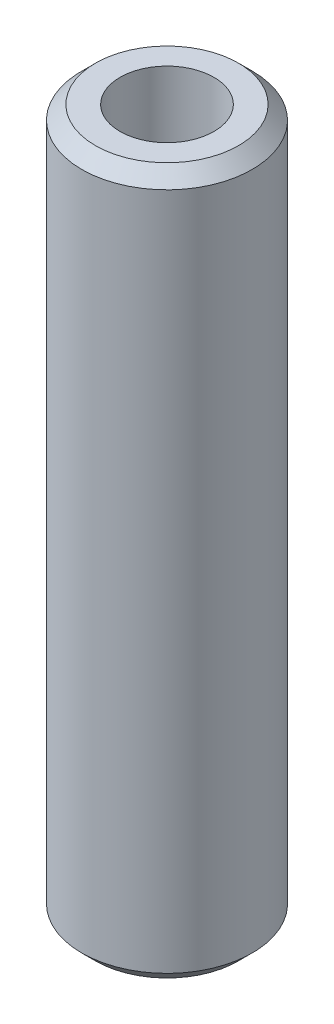
ISO-10303-21;
HEADER;
FILE_DESCRIPTION(('STEP AP214'),'2;1');
FILE_NAME('part.step','',(''),(''),'','','');
FILE_SCHEMA(('AUTOMOTIVE_DESIGN { 1 0 10303 214 1 1 1 1 }'));
ENDSEC;
DATA;
#1=APPLICATION_CONTEXT('core data for automotive mechanical design processes');
#2=APPLICATION_PROTOCOL_DEFINITION('international standard','automotive_design',2000,#1);
#3=PRODUCT_CONTEXT('',#1,'mechanical');
#4=PRODUCT('Part','Part','',(#3));
#5=PRODUCT_RELATED_PRODUCT_CATEGORY('part','',(#4));
#6=PRODUCT_DEFINITION_FORMATION('','',#4);
#7=PRODUCT_DEFINITION_CONTEXT('part definition',#1,'design');
#8=PRODUCT_DEFINITION('design','',#6,#7);
#9=PRODUCT_DEFINITION_SHAPE('','',#8);
#10=(LENGTH_UNIT() NAMED_UNIT(*) SI_UNIT(.MILLI.,.METRE.));
#11=(NAMED_UNIT(*) PLANE_ANGLE_UNIT() SI_UNIT($,.RADIAN.));
#12=(NAMED_UNIT(*) SI_UNIT($,.STERADIAN.) SOLID_ANGLE_UNIT());
#13=UNCERTAINTY_MEASURE_WITH_UNIT(LENGTH_MEASURE(1.E-05),#10,'distance_accuracy_value','');
#14=(GEOMETRIC_REPRESENTATION_CONTEXT(3) GLOBAL_UNCERTAINTY_ASSIGNED_CONTEXT((#13)) GLOBAL_UNIT_ASSIGNED_CONTEXT((#10,
#11,#12)) REPRESENTATION_CONTEXT('',''));
#15=CARTESIAN_POINT('',(0.,0.,0.));
#16=DIRECTION('',(0.,0.,1.));
#17=DIRECTION('',(1.,0.,0.));
#18=AXIS2_PLACEMENT_3D('',#15,#16,#17);
#19=CARTESIAN_POINT('',(0.,186.33929071321,0.));
#20=DIRECTION('',(0.,-1.,0.));
#21=DIRECTION('',(0.,0.,-1.));
#22=AXIS2_PLACEMENT_3D('',#19,#20,#21);
#23=CYLINDRICAL_SURFACE('',#22,22.5);
#24=CARTESIAN_POINT('',(0.,182.714145136499,0.));
#25=DIRECTION('',(0.,1.,0.));
#26=DIRECTION('',(0.,0.,1.));
#27=AXIS2_PLACEMENT_3D('',#24,#25,#26);
#28=CIRCLE('',#27,22.5);
#29=CARTESIAN_POINT('',(0.,182.714145136499,22.5));
#30=VERTEX_POINT('',#29);
#31=EDGE_CURVE('E50',#30,#30,#28,.F.);
#32=ORIENTED_EDGE('',*,*,#31,.T.);
#33=EDGE_LOOP('',(#32));
#34=FACE_BOUND('',#33,.T.);
#35=CARTESIAN_POINT('',(0.,3.62514557671095,0.));
#36=DIRECTION('',(0.,1.,0.));
#37=DIRECTION('',(0.,0.,1.));
#38=AXIS2_PLACEMENT_3D('',#35,#36,#37);
#39=CIRCLE('',#38,22.5);
#40=CARTESIAN_POINT('',(0.,3.62514557671095,22.5));
#41=VERTEX_POINT('',#40);
#42=EDGE_CURVE('E51',#41,#41,#39,.T.);
#43=ORIENTED_EDGE('',*,*,#42,.T.);
#44=EDGE_LOOP('',(#43));
#45=FACE_BOUND('',#44,.T.);
#46=ADVANCED_FACE('F39',(#34,#45),#23,.T.);
#47=CARTESIAN_POINT('',(0.,186.33929071321,0.));
#48=DIRECTION('',(0.,1.,0.));
#49=DIRECTION('',(0.,0.,1.));
#50=AXIS2_PLACEMENT_3D('',#47,#48,#49);
#51=PLANE('',#50);
#52=CARTESIAN_POINT('',(0.,186.33929071321,0.));
#53=DIRECTION('',(0.,1.,0.));
#54=DIRECTION('',(0.,0.,1.));
#55=AXIS2_PLACEMENT_3D('',#52,#53,#54);
#56=CIRCLE('',#55,18.8748544232891);
#57=CARTESIAN_POINT('',(0.,186.33929071321,18.8748544232891));
#58=VERTEX_POINT('',#57);
#59=EDGE_CURVE('E54',#58,#58,#56,.T.);
#60=ORIENTED_EDGE('',*,*,#59,.T.);
#61=EDGE_LOOP('',(#60));
#62=FACE_BOUND('',#61,.T.);
#63=CARTESIAN_POINT('',(0.,186.33929071321,0.));
#64=DIRECTION('',(0.,1.,0.));
#65=DIRECTION('',(0.,0.,1.));
#66=AXIS2_PLACEMENT_3D('',#63,#64,#65);
#67=CIRCLE('',#66,12.3929980128134);
#68=CARTESIAN_POINT('',(0.,186.33929071321,12.3929980128134));
#69=VERTEX_POINT('',#68);
#70=EDGE_CURVE('E58',#69,#69,#67,.T.);
#71=ORIENTED_EDGE('',*,*,#70,.F.);
#72=EDGE_LOOP('',(#71));
#73=FACE_BOUND('',#72,.T.);
#74=ADVANCED_FACE('F69',(#62,#73),#51,.T.);
#75=CARTESIAN_POINT('',(0.,0.,0.));
#76=DIRECTION('',(0.,1.,0.));
#77=DIRECTION('',(0.,0.,1.));
#78=AXIS2_PLACEMENT_3D('',#75,#76,#77);
#79=PLANE('',#78);
#80=CARTESIAN_POINT('',(0.,0.,0.));
#81=DIRECTION('',(0.,1.,0.));
#82=DIRECTION('',(0.,0.,1.));
#83=AXIS2_PLACEMENT_3D('',#80,#81,#82);
#84=CIRCLE('',#83,18.8748544232891);
#85=CARTESIAN_POINT('',(0.,0.,18.8748544232891));
#86=VERTEX_POINT('',#85);
#87=EDGE_CURVE('E10',#86,#86,#84,.F.);
#88=ORIENTED_EDGE('',*,*,#87,.T.);
#89=EDGE_LOOP('',(#88));
#90=FACE_BOUND('',#89,.T.);
#91=CARTESIAN_POINT('',(0.,0.,0.));
#92=DIRECTION('',(0.,1.,0.));
#93=DIRECTION('',(0.,0.,1.));
#94=AXIS2_PLACEMENT_3D('',#91,#92,#93);
#95=CIRCLE('',#94,12.3929980128134);
#96=CARTESIAN_POINT('',(0.,0.,12.3929980128134));
#97=VERTEX_POINT('',#96);
#98=EDGE_CURVE('E63',#97,#97,#95,.T.);
#99=ORIENTED_EDGE('',*,*,#98,.T.);
#100=EDGE_LOOP('',(#99));
#101=FACE_BOUND('',#100,.T.);
#102=ADVANCED_FACE('F75',(#90,#101),#79,.F.);
#103=CARTESIAN_POINT('',(0.,186.33929071321,0.));
#104=DIRECTION('',(0.,-1.,0.));
#105=DIRECTION('',(0.,0.,-1.));
#106=AXIS2_PLACEMENT_3D('',#103,#104,#105);
#107=CYLINDRICAL_SURFACE('',#106,12.3929980128134);
#108=ORIENTED_EDGE('',*,*,#70,.T.);
#109=EDGE_LOOP('',(#108));
#110=FACE_BOUND('',#109,.T.);
#111=ORIENTED_EDGE('',*,*,#98,.F.);
#112=EDGE_LOOP('',(#111));
#113=FACE_BOUND('',#112,.T.);
#114=ADVANCED_FACE('F70',(#110,#113),#107,.F.);
#115=CARTESIAN_POINT('',(0.,186.33929071321,0.));
#116=DIRECTION('',(0.,-1.,0.));
#117=DIRECTION('',(0.,0.,-1.));
#118=AXIS2_PLACEMENT_3D('',#115,#116,#117);
#119=CONICAL_SURFACE('',#118,18.8748544232891,0.785398163397442);
#120=ORIENTED_EDGE('',*,*,#31,.F.);
#121=EDGE_LOOP('',(#120));
#122=FACE_BOUND('',#121,.T.);
#123=ORIENTED_EDGE('',*,*,#59,.F.);
#124=EDGE_LOOP('',(#123));
#125=FACE_BOUND('',#124,.T.);
#126=ADVANCED_FACE('F81',(#122,#125),#119,.T.);
#127=CARTESIAN_POINT('',(0.,3.62514557671095,0.));
#128=DIRECTION('',(0.,1.,0.));
#129=DIRECTION('',(0.,0.,1.));
#130=AXIS2_PLACEMENT_3D('',#127,#128,#129);
#131=CONICAL_SURFACE('',#130,22.5,0.785398163397448);
#132=ORIENTED_EDGE('',*,*,#87,.F.);
#133=EDGE_LOOP('',(#132));
#134=FACE_BOUND('',#133,.T.);
#135=ORIENTED_EDGE('',*,*,#42,.F.);
#136=EDGE_LOOP('',(#135));
#137=FACE_BOUND('',#136,.T.);
#138=ADVANCED_FACE('F45',(#134,#137),#131,.T.);
#139=CLOSED_SHELL('',(#46,#74,#102,#114,#126,#138));
#140=MANIFOLD_SOLID_BREP('B2',#139);
#141=ADVANCED_BREP_SHAPE_REPRESENTATION('',(#18,#140),#14);
#142=SHAPE_DEFINITION_REPRESENTATION(#9,#141);
ENDSEC;
END-ISO-10303-21;
